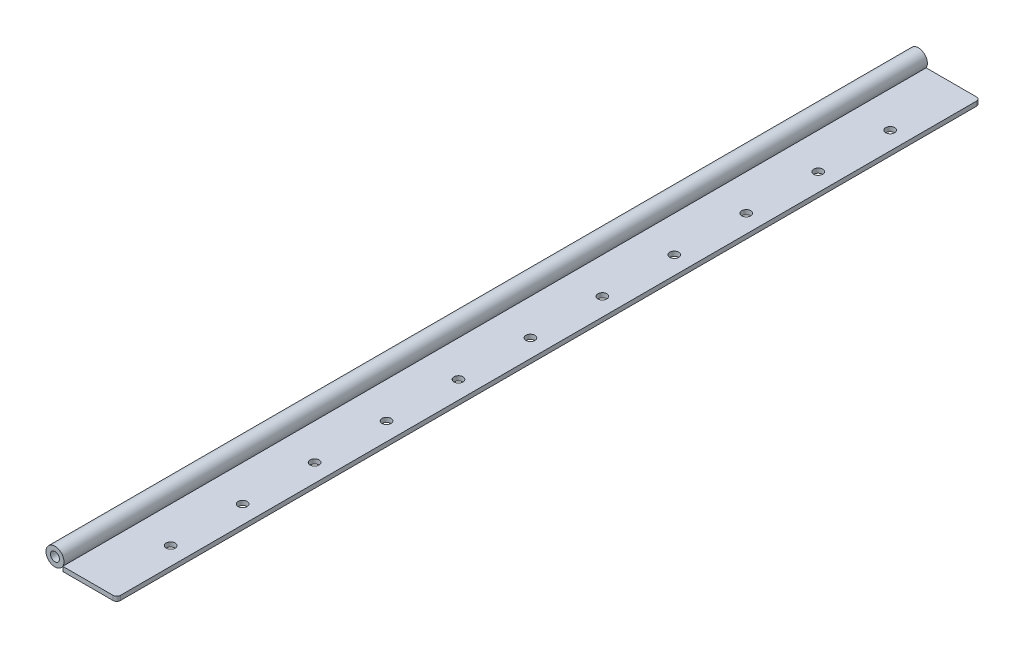
ISO-10303-21;
HEADER;
FILE_DESCRIPTION(('STEP AP214'),'2;1');
FILE_NAME('part.step','',(''),(''),'','','');
FILE_SCHEMA(('AUTOMOTIVE_DESIGN { 1 0 10303 214 1 1 1 1 }'));
ENDSEC;
DATA;
#1=APPLICATION_CONTEXT('core data for automotive mechanical design processes');
#2=APPLICATION_PROTOCOL_DEFINITION('international standard','automotive_design',2000,#1);
#3=PRODUCT_CONTEXT('',#1,'mechanical');
#4=PRODUCT('Part','Part','',(#3));
#5=PRODUCT_RELATED_PRODUCT_CATEGORY('part','',(#4));
#6=PRODUCT_DEFINITION_FORMATION('','',#4);
#7=PRODUCT_DEFINITION_CONTEXT('part definition',#1,'design');
#8=PRODUCT_DEFINITION('design','',#6,#7);
#9=PRODUCT_DEFINITION_SHAPE('','',#8);
#10=(LENGTH_UNIT() NAMED_UNIT(*) SI_UNIT(.MILLI.,.METRE.));
#11=(NAMED_UNIT(*) PLANE_ANGLE_UNIT() SI_UNIT($,.RADIAN.));
#12=(NAMED_UNIT(*) SI_UNIT($,.STERADIAN.) SOLID_ANGLE_UNIT());
#13=UNCERTAINTY_MEASURE_WITH_UNIT(LENGTH_MEASURE(1.E-05),#10,'distance_accuracy_value','');
#14=(GEOMETRIC_REPRESENTATION_CONTEXT(3) GLOBAL_UNCERTAINTY_ASSIGNED_CONTEXT((#13)) GLOBAL_UNIT_ASSIGNED_CONTEXT((#10,
#11,#12)) REPRESENTATION_CONTEXT('',''));
#15=CARTESIAN_POINT('',(0.,0.,0.));
#16=DIRECTION('',(0.,0.,1.));
#17=DIRECTION('',(1.,0.,0.));
#18=AXIS2_PLACEMENT_3D('',#15,#16,#17);
#19=CARTESIAN_POINT('',(-5.49926131403118,6.35,-609.6));
#20=DIRECTION('',(0.,0.,1.));
#21=DIRECTION('',(1.,0.,0.));
#22=AXIS2_PLACEMENT_3D('',#19,#20,#21);
#23=CYLINDRICAL_SURFACE('',#22,6.35);
#24=CARTESIAN_POINT('',(-5.49926131403118,6.35,-609.6));
#25=DIRECTION('',(0.,0.,1.));
#26=DIRECTION('',(1.,0.,0.));
#27=AXIS2_PLACEMENT_3D('',#24,#25,#26);
#28=CIRCLE('',#27,6.35);
#29=CARTESIAN_POINT('',(0.850738685968815,6.35,-609.6));
#30=VERTEX_POINT('',#29);
#31=EDGE_CURVE('E11',#30,#30,#28,.T.);
#32=ORIENTED_EDGE('',*,*,#31,.T.);
#33=EDGE_LOOP('',(#32));
#34=FACE_BOUND('',#33,.T.);
#35=CARTESIAN_POINT('',(-5.49926131403118,6.35,0.));
#36=DIRECTION('',(0.,0.,1.));
#37=DIRECTION('',(1.,0.,0.));
#38=AXIS2_PLACEMENT_3D('',#35,#36,#37);
#39=CIRCLE('',#38,6.35);
#40=CARTESIAN_POINT('',(0.850738685968815,6.35,0.));
#41=VERTEX_POINT('',#40);
#42=EDGE_CURVE('E48',#41,#41,#39,.T.);
#43=ORIENTED_EDGE('',*,*,#42,.F.);
#44=EDGE_LOOP('',(#43));
#45=FACE_BOUND('',#44,.T.);
#46=ADVANCED_FACE('F45',(#34,#45),#23,.T.);
#47=CARTESIAN_POINT('',(-5.49926131403118,6.35,-609.6));
#48=DIRECTION('',(0.,0.,1.));
#49=DIRECTION('',(1.,0.,0.));
#50=AXIS2_PLACEMENT_3D('',#47,#48,#49);
#51=PLANE('',#50);
#52=CARTESIAN_POINT('',(-5.49926131403118,6.35,-609.6));
#53=DIRECTION('',(0.,0.,1.));
#54=DIRECTION('',(1.,0.,0.));
#55=AXIS2_PLACEMENT_3D('',#52,#53,#54);
#56=CIRCLE('',#55,3.175);
#57=CARTESIAN_POINT('',(-2.32426131403118,6.35,-609.6));
#58=VERTEX_POINT('',#57);
#59=EDGE_CURVE('E55',#58,#58,#56,.T.);
#60=ORIENTED_EDGE('',*,*,#59,.T.);
#61=EDGE_LOOP('',(#60));
#62=FACE_BOUND('',#61,.T.);
#63=ORIENTED_EDGE('',*,*,#31,.F.);
#64=EDGE_LOOP('',(#63));
#65=FACE_BOUND('',#64,.T.);
#66=ADVANCED_FACE('F63',(#62,#65),#51,.F.);
#67=CARTESIAN_POINT('',(-5.49926131403118,6.35,0.));
#68=DIRECTION('',(0.,0.,1.));
#69=DIRECTION('',(1.,0.,0.));
#70=AXIS2_PLACEMENT_3D('',#67,#68,#69);
#71=PLANE('',#70);
#72=CARTESIAN_POINT('',(-5.49926131403118,6.35,0.));
#73=DIRECTION('',(0.,0.,1.));
#74=DIRECTION('',(1.,0.,0.));
#75=AXIS2_PLACEMENT_3D('',#72,#73,#74);
#76=CIRCLE('',#75,3.175);
#77=CARTESIAN_POINT('',(-2.32426131403118,6.35,0.));
#78=VERTEX_POINT('',#77);
#79=EDGE_CURVE('E57',#78,#78,#76,.T.);
#80=ORIENTED_EDGE('',*,*,#79,.F.);
#81=EDGE_LOOP('',(#80));
#82=FACE_BOUND('',#81,.T.);
#83=ORIENTED_EDGE('',*,*,#42,.T.);
#84=EDGE_LOOP('',(#83));
#85=FACE_BOUND('',#84,.T.);
#86=ADVANCED_FACE('F69',(#82,#85),#71,.T.);
#87=CARTESIAN_POINT('',(-5.49926131403118,6.35,-609.6));
#88=DIRECTION('',(0.,0.,1.));
#89=DIRECTION('',(1.,0.,0.));
#90=AXIS2_PLACEMENT_3D('',#87,#88,#89);
#91=CYLINDRICAL_SURFACE('',#90,3.175);
#92=ORIENTED_EDGE('',*,*,#59,.F.);
#93=EDGE_LOOP('',(#92));
#94=FACE_BOUND('',#93,.T.);
#95=ORIENTED_EDGE('',*,*,#79,.T.);
#96=EDGE_LOOP('',(#95));
#97=FACE_BOUND('',#96,.T.);
#98=ADVANCED_FACE('F66',(#94,#97),#91,.F.);
#99=CLOSED_SHELL('',(#46,#66,#86,#98));
#100=MANIFOLD_SOLID_BREP('B2',#99);
#101=CARTESIAN_POINT('',(0.,3.175,0.));
#102=DIRECTION('',(1.,0.,0.));
#103=DIRECTION('',(0.,0.,-1.));
#104=AXIS2_PLACEMENT_3D('',#101,#102,#103);
#105=PLANE('',#104);
#106=DIRECTION('',(0.,0.,1.));
#107=VECTOR('',#106,1.);
#108=CARTESIAN_POINT('',(0.,0.,0.));
#109=LINE('',#108,#107);
#110=CARTESIAN_POINT('',(-1.11022302462516E-13,0.,-609.6));
#111=VERTEX_POINT('',#110);
#112=CARTESIAN_POINT('',(0.,0.,0.));
#113=VERTEX_POINT('',#112);
#114=EDGE_CURVE('E179',#111,#113,#109,.T.);
#115=ORIENTED_EDGE('',*,*,#114,.T.);
#116=DIRECTION('',(0.,-1.,0.));
#117=VECTOR('',#116,1.);
#118=CARTESIAN_POINT('',(0.,3.175,0.));
#119=LINE('',#118,#117);
#120=CARTESIAN_POINT('',(0.,3.175,0.));
#121=VERTEX_POINT('',#120);
#122=EDGE_CURVE('E164',#121,#113,#119,.T.);
#123=ORIENTED_EDGE('',*,*,#122,.F.);
#124=DIRECTION('',(0.,0.,1.));
#125=VECTOR('',#124,1.);
#126=CARTESIAN_POINT('',(0.,3.175,0.));
#127=LINE('',#126,#125);
#128=CARTESIAN_POINT('',(-1.11022302462516E-13,3.175,-609.6));
#129=VERTEX_POINT('',#128);
#130=EDGE_CURVE('E168',#129,#121,#127,.T.);
#131=ORIENTED_EDGE('',*,*,#130,.F.);
#132=DIRECTION('',(0.,-1.,0.));
#133=VECTOR('',#132,1.);
#134=CARTESIAN_POINT('',(-1.11022302462516E-13,3.175,-609.6));
#135=LINE('',#134,#133);
#136=EDGE_CURVE('E181',#129,#111,#135,.T.);
#137=ORIENTED_EDGE('',*,*,#136,.T.);
#138=EDGE_LOOP('',(#115,#123,#131,#137));
#139=FACE_BOUND('',#138,.T.);
#140=ADVANCED_FACE('F107',(#139),#105,.F.);
#141=CARTESIAN_POINT('',(0.,3.175,0.));
#142=DIRECTION('',(0.,0.,-1.));
#143=DIRECTION('',(-1.,0.,0.));
#144=AXIS2_PLACEMENT_3D('',#141,#142,#143);
#145=PLANE('',#144);
#146=DIRECTION('',(1.,0.,0.));
#147=VECTOR('',#146,1.);
#148=CARTESIAN_POINT('',(0.,0.,0.));
#149=LINE('',#148,#147);
#150=CARTESIAN_POINT('',(35.56,0.,0.));
#151=VERTEX_POINT('',#150);
#152=EDGE_CURVE('E207',#113,#151,#149,.T.);
#153=ORIENTED_EDGE('',*,*,#152,.T.);
#154=DIRECTION('',(0.,-1.,0.));
#155=VECTOR('',#154,1.);
#156=CARTESIAN_POINT('',(35.56,3.175,0.));
#157=LINE('',#156,#155);
#158=CARTESIAN_POINT('',(35.56,3.175,0.));
#159=VERTEX_POINT('',#158);
#160=EDGE_CURVE('E130',#151,#159,#157,.F.);
#161=ORIENTED_EDGE('',*,*,#160,.T.);
#162=DIRECTION('',(1.,0.,0.));
#163=VECTOR('',#162,1.);
#164=CARTESIAN_POINT('',(0.,3.175,0.));
#165=LINE('',#164,#163);
#166=EDGE_CURVE('E160',#121,#159,#165,.T.);
#167=ORIENTED_EDGE('',*,*,#166,.F.);
#168=ORIENTED_EDGE('',*,*,#122,.T.);
#169=EDGE_LOOP('',(#153,#161,#167,#168));
#170=FACE_BOUND('',#169,.T.);
#171=ADVANCED_FACE('F162',(#170),#145,.F.);
#172=CARTESIAN_POINT('',(38.1,3.175,0.));
#173=DIRECTION('',(-1.,0.,0.));
#174=DIRECTION('',(0.,0.,1.));
#175=AXIS2_PLACEMENT_3D('',#172,#173,#174);
#176=PLANE('',#175);
#177=DIRECTION('',(0.,0.,-1.));
#178=VECTOR('',#177,1.);
#179=CARTESIAN_POINT('',(38.1,3.175,0.));
#180=LINE('',#179,#178);
#181=CARTESIAN_POINT('',(38.1,3.175,-2.54));
#182=VERTEX_POINT('',#181);
#183=CARTESIAN_POINT('',(38.0999999999999,3.175,-607.06));
#184=VERTEX_POINT('',#183);
#185=EDGE_CURVE('E167',#182,#184,#180,.T.);
#186=ORIENTED_EDGE('',*,*,#185,.F.);
#187=DIRECTION('',(0.,-1.,0.));
#188=VECTOR('',#187,1.);
#189=CARTESIAN_POINT('',(38.1,3.175,-2.54));
#190=LINE('',#189,#188);
#191=CARTESIAN_POINT('',(38.1,0.,-2.54));
#192=VERTEX_POINT('',#191);
#193=EDGE_CURVE('E183',#182,#192,#190,.T.);
#194=ORIENTED_EDGE('',*,*,#193,.T.);
#195=DIRECTION('',(0.,0.,-1.));
#196=VECTOR('',#195,1.);
#197=CARTESIAN_POINT('',(38.1,0.,0.));
#198=LINE('',#197,#196);
#199=CARTESIAN_POINT('',(38.0999999999999,0.,-607.06));
#200=VERTEX_POINT('',#199);
#201=EDGE_CURVE('E208',#192,#200,#198,.T.);
#202=ORIENTED_EDGE('',*,*,#201,.T.);
#203=DIRECTION('',(0.,-1.,0.));
#204=VECTOR('',#203,1.);
#205=CARTESIAN_POINT('',(38.0999999999999,3.175,-607.06));
#206=LINE('',#205,#204);
#207=EDGE_CURVE('E180',#200,#184,#206,.F.);
#208=ORIENTED_EDGE('',*,*,#207,.T.);
#209=EDGE_LOOP('',(#186,#194,#202,#208));
#210=FACE_BOUND('',#209,.T.);
#211=ADVANCED_FACE('F199',(#210),#176,.F.);
#212=CARTESIAN_POINT('',(-1.11022302462516E-13,3.175,-609.6));
#213=DIRECTION('',(0.,0.,1.));
#214=DIRECTION('',(1.,0.,0.));
#215=AXIS2_PLACEMENT_3D('',#212,#213,#214);
#216=PLANE('',#215);
#217=DIRECTION('',(-1.,0.,0.));
#218=VECTOR('',#217,1.);
#219=CARTESIAN_POINT('',(-1.11022302462516E-13,3.175,-609.6));
#220=LINE('',#219,#218);
#221=CARTESIAN_POINT('',(35.5599999999999,3.175,-609.6));
#222=VERTEX_POINT('',#221);
#223=EDGE_CURVE('E172',#222,#129,#220,.T.);
#224=ORIENTED_EDGE('',*,*,#223,.F.);
#225=DIRECTION('',(0.,-1.,0.));
#226=VECTOR('',#225,1.);
#227=CARTESIAN_POINT('',(35.5599999999999,3.175,-609.6));
#228=LINE('',#227,#226);
#229=CARTESIAN_POINT('',(35.5599999999999,0.,-609.6));
#230=VERTEX_POINT('',#229);
#231=EDGE_CURVE('E43',#222,#230,#228,.T.);
#232=ORIENTED_EDGE('',*,*,#231,.T.);
#233=DIRECTION('',(-1.,0.,0.));
#234=VECTOR('',#233,1.);
#235=CARTESIAN_POINT('',(-1.11022302462516E-13,0.,-609.6));
#236=LINE('',#235,#234);
#237=EDGE_CURVE('E176',#230,#111,#236,.T.);
#238=ORIENTED_EDGE('',*,*,#237,.T.);
#239=ORIENTED_EDGE('',*,*,#136,.F.);
#240=EDGE_LOOP('',(#224,#232,#238,#239));
#241=FACE_BOUND('',#240,.T.);
#242=ADVANCED_FACE('F216',(#241),#216,.F.);
#243=CARTESIAN_POINT('',(-1.11022302462516E-13,3.175,-609.6));
#244=DIRECTION('',(0.,-1.,0.));
#245=DIRECTION('',(0.,0.,-1.));
#246=AXIS2_PLACEMENT_3D('',#243,#244,#245);
#247=PLANE('',#246);
#248=CARTESIAN_POINT('',(25.3999999999999,3.175,-152.4));
#249=DIRECTION('',(0.,1.,0.));
#250=DIRECTION('',(0.,0.,-1.));
#251=AXIS2_PLACEMENT_3D('',#248,#249,#250);
#252=CIRCLE('',#251,3.17499999999999);
#253=CARTESIAN_POINT('',(25.3999999999999,3.175,-155.575));
#254=VERTEX_POINT('',#253);
#255=EDGE_CURVE('E291',#254,#254,#252,.T.);
#256=ORIENTED_EDGE('',*,*,#255,.F.);
#257=EDGE_LOOP('',(#256));
#258=FACE_BOUND('',#257,.T.);
#259=CARTESIAN_POINT('',(25.3999999999999,3.175,-203.2));
#260=DIRECTION('',(0.,1.,0.));
#261=DIRECTION('',(0.,0.,-1.));
#262=AXIS2_PLACEMENT_3D('',#259,#260,#261);
#263=CIRCLE('',#262,3.17499999999999);
#264=CARTESIAN_POINT('',(25.3999999999999,3.175,-206.375));
#265=VERTEX_POINT('',#264);
#266=EDGE_CURVE('E295',#265,#265,#263,.T.);
#267=ORIENTED_EDGE('',*,*,#266,.F.);
#268=EDGE_LOOP('',(#267));
#269=FACE_BOUND('',#268,.T.);
#270=CARTESIAN_POINT('',(25.4,3.175,-50.8000000000001));
#271=DIRECTION('',(0.,1.,0.));
#272=DIRECTION('',(0.,0.,-1.));
#273=AXIS2_PLACEMENT_3D('',#270,#271,#272);
#274=CIRCLE('',#273,3.17499999999999);
#275=CARTESIAN_POINT('',(25.4,3.175,-53.975));
#276=VERTEX_POINT('',#275);
#277=EDGE_CURVE('E302',#276,#276,#274,.T.);
#278=ORIENTED_EDGE('',*,*,#277,.F.);
#279=EDGE_LOOP('',(#278));
#280=FACE_BOUND('',#279,.T.);
#281=CARTESIAN_POINT('',(25.3999999999999,3.175,-101.6));
#282=DIRECTION('',(0.,1.,0.));
#283=DIRECTION('',(0.,0.,-1.));
#284=AXIS2_PLACEMENT_3D('',#281,#282,#283);
#285=CIRCLE('',#284,3.17499999999999);
#286=CARTESIAN_POINT('',(25.3999999999999,3.175,-104.775));
#287=VERTEX_POINT('',#286);
#288=EDGE_CURVE('E308',#287,#287,#285,.T.);
#289=ORIENTED_EDGE('',*,*,#288,.F.);
#290=EDGE_LOOP('',(#289));
#291=FACE_BOUND('',#290,.T.);
#292=CARTESIAN_POINT('',(25.3999999999999,3.175,-558.8));
#293=DIRECTION('',(0.,1.,0.));
#294=DIRECTION('',(0.,0.,1.));
#295=AXIS2_PLACEMENT_3D('',#292,#293,#294);
#296=CIRCLE('',#295,3.175);
#297=CARTESIAN_POINT('',(25.3999999999999,3.175,-555.625));
#298=VERTEX_POINT('',#297);
#299=EDGE_CURVE('E314',#298,#298,#296,.T.);
#300=ORIENTED_EDGE('',*,*,#299,.F.);
#301=EDGE_LOOP('',(#300));
#302=FACE_BOUND('',#301,.T.);
#303=CARTESIAN_POINT('',(25.3999999999999,3.175,-508.));
#304=DIRECTION('',(0.,1.,0.));
#305=DIRECTION('',(0.,0.,1.));
#306=AXIS2_PLACEMENT_3D('',#303,#304,#305);
#307=CIRCLE('',#306,3.175);
#308=CARTESIAN_POINT('',(25.3999999999999,3.175,-504.825));
#309=VERTEX_POINT('',#308);
#310=EDGE_CURVE('E320',#309,#309,#307,.T.);
#311=ORIENTED_EDGE('',*,*,#310,.F.);
#312=EDGE_LOOP('',(#311));
#313=FACE_BOUND('',#312,.T.);
#314=CARTESIAN_POINT('',(25.3999999999999,3.175,-457.2));
#315=DIRECTION('',(0.,1.,0.));
#316=DIRECTION('',(0.,0.,1.));
#317=AXIS2_PLACEMENT_3D('',#314,#315,#316);
#318=CIRCLE('',#317,3.175);
#319=CARTESIAN_POINT('',(25.3999999999999,3.175,-454.025));
#320=VERTEX_POINT('',#319);
#321=EDGE_CURVE('E326',#320,#320,#318,.T.);
#322=ORIENTED_EDGE('',*,*,#321,.F.);
#323=EDGE_LOOP('',(#322));
#324=FACE_BOUND('',#323,.T.);
#325=CARTESIAN_POINT('',(25.3999999999999,3.175,-406.4));
#326=DIRECTION('',(0.,1.,0.));
#327=DIRECTION('',(0.,0.,1.));
#328=AXIS2_PLACEMENT_3D('',#325,#326,#327);
#329=CIRCLE('',#328,3.175);
#330=CARTESIAN_POINT('',(25.3999999999999,3.175,-403.225));
#331=VERTEX_POINT('',#330);
#332=EDGE_CURVE('E332',#331,#331,#329,.T.);
#333=ORIENTED_EDGE('',*,*,#332,.F.);
#334=EDGE_LOOP('',(#333));
#335=FACE_BOUND('',#334,.T.);
#336=CARTESIAN_POINT('',(25.3999999999999,3.175,-254.));
#337=DIRECTION('',(0.,1.,0.));
#338=DIRECTION('',(0.,0.,-1.));
#339=AXIS2_PLACEMENT_3D('',#336,#337,#338);
#340=CIRCLE('',#339,3.17499999999999);
#341=CARTESIAN_POINT('',(25.3999999999999,3.175,-257.175));
#342=VERTEX_POINT('',#341);
#343=EDGE_CURVE('E338',#342,#342,#340,.T.);
#344=ORIENTED_EDGE('',*,*,#343,.F.);
#345=EDGE_LOOP('',(#344));
#346=FACE_BOUND('',#345,.T.);
#347=CARTESIAN_POINT('',(25.3999999999999,3.175,-304.8));
#348=DIRECTION('',(0.,1.,0.));
#349=DIRECTION('',(0.,0.,1.));
#350=AXIS2_PLACEMENT_3D('',#347,#348,#349);
#351=CIRCLE('',#350,3.175);
#352=CARTESIAN_POINT('',(25.3999999999999,3.175,-301.625));
#353=VERTEX_POINT('',#352);
#354=EDGE_CURVE('E344',#353,#353,#351,.T.);
#355=ORIENTED_EDGE('',*,*,#354,.F.);
#356=EDGE_LOOP('',(#355));
#357=FACE_BOUND('',#356,.T.);
#358=CARTESIAN_POINT('',(25.3999999999999,3.175,-355.6));
#359=DIRECTION('',(0.,1.,0.));
#360=DIRECTION('',(0.,0.,1.));
#361=AXIS2_PLACEMENT_3D('',#358,#359,#360);
#362=CIRCLE('',#361,3.175);
#363=CARTESIAN_POINT('',(25.3999999999999,3.175,-352.425));
#364=VERTEX_POINT('',#363);
#365=EDGE_CURVE('E211',#364,#364,#362,.T.);
#366=ORIENTED_EDGE('',*,*,#365,.F.);
#367=EDGE_LOOP('',(#366));
#368=FACE_BOUND('',#367,.T.);
#369=ORIENTED_EDGE('',*,*,#166,.T.);
#370=CARTESIAN_POINT('',(35.56,3.175,-2.54));
#371=DIRECTION('',(0.,-1.,0.));
#372=DIRECTION('',(0.,0.,-1.));
#373=AXIS2_PLACEMENT_3D('',#370,#371,#372);
#374=CIRCLE('',#373,2.54);
#375=EDGE_CURVE('E115',#159,#182,#374,.F.);
#376=ORIENTED_EDGE('',*,*,#375,.T.);
#377=ORIENTED_EDGE('',*,*,#185,.T.);
#378=CARTESIAN_POINT('',(35.5599999999999,3.175,-607.06));
#379=DIRECTION('',(0.,-1.,0.));
#380=DIRECTION('',(0.,0.,-1.));
#381=AXIS2_PLACEMENT_3D('',#378,#379,#380);
#382=CIRCLE('',#381,2.54);
#383=EDGE_CURVE('E122',#184,#222,#382,.F.);
#384=ORIENTED_EDGE('',*,*,#383,.T.);
#385=ORIENTED_EDGE('',*,*,#223,.T.);
#386=ORIENTED_EDGE('',*,*,#130,.T.);
#387=EDGE_LOOP('',(#369,#376,#377,#384,#385,#386));
#388=FACE_BOUND('',#387,.T.);
#389=ADVANCED_FACE('F171',(#258,#269,#280,#291,#302,#313,#324,#335,#346,#357,#368,#388),#247,.F.);
#390=CARTESIAN_POINT('',(-1.11022302462516E-13,0.,-609.6));
#391=DIRECTION('',(0.,-1.,0.));
#392=DIRECTION('',(0.,0.,-1.));
#393=AXIS2_PLACEMENT_3D('',#390,#391,#392);
#394=PLANE('',#393);
#395=CARTESIAN_POINT('',(25.3999999999999,0.,-152.4));
#396=DIRECTION('',(0.,-1.,0.));
#397=DIRECTION('',(0.,0.,-1.));
#398=AXIS2_PLACEMENT_3D('',#395,#396,#397);
#399=CIRCLE('',#398,3.17499999999999);
#400=CARTESIAN_POINT('',(25.3999999999999,0.,-155.575));
#401=VERTEX_POINT('',#400);
#402=EDGE_CURVE('E288',#401,#401,#399,.F.);
#403=ORIENTED_EDGE('',*,*,#402,.T.);
#404=EDGE_LOOP('',(#403));
#405=FACE_BOUND('',#404,.T.);
#406=CARTESIAN_POINT('',(25.3999999999999,0.,-203.2));
#407=DIRECTION('',(0.,-1.,0.));
#408=DIRECTION('',(0.,0.,-1.));
#409=AXIS2_PLACEMENT_3D('',#406,#407,#408);
#410=CIRCLE('',#409,3.17499999999999);
#411=CARTESIAN_POINT('',(25.3999999999999,0.,-206.375));
#412=VERTEX_POINT('',#411);
#413=EDGE_CURVE('E292',#412,#412,#410,.F.);
#414=ORIENTED_EDGE('',*,*,#413,.T.);
#415=EDGE_LOOP('',(#414));
#416=FACE_BOUND('',#415,.T.);
#417=CARTESIAN_POINT('',(25.4,0.,-50.8000000000001));
#418=DIRECTION('',(0.,-1.,0.));
#419=DIRECTION('',(0.,0.,-1.));
#420=AXIS2_PLACEMENT_3D('',#417,#418,#419);
#421=CIRCLE('',#420,3.17499999999999);
#422=CARTESIAN_POINT('',(25.4,0.,-53.975));
#423=VERTEX_POINT('',#422);
#424=EDGE_CURVE('E300',#423,#423,#421,.F.);
#425=ORIENTED_EDGE('',*,*,#424,.T.);
#426=EDGE_LOOP('',(#425));
#427=FACE_BOUND('',#426,.T.);
#428=CARTESIAN_POINT('',(25.3999999999999,0.,-101.6));
#429=DIRECTION('',(0.,-1.,0.));
#430=DIRECTION('',(0.,0.,-1.));
#431=AXIS2_PLACEMENT_3D('',#428,#429,#430);
#432=CIRCLE('',#431,3.17499999999999);
#433=CARTESIAN_POINT('',(25.3999999999999,0.,-104.775));
#434=VERTEX_POINT('',#433);
#435=EDGE_CURVE('E305',#434,#434,#432,.F.);
#436=ORIENTED_EDGE('',*,*,#435,.T.);
#437=EDGE_LOOP('',(#436));
#438=FACE_BOUND('',#437,.T.);
#439=CARTESIAN_POINT('',(25.3999999999999,0.,-558.8));
#440=DIRECTION('',(0.,-1.,0.));
#441=DIRECTION('',(0.,0.,-1.));
#442=AXIS2_PLACEMENT_3D('',#439,#440,#441);
#443=CIRCLE('',#442,3.175);
#444=CARTESIAN_POINT('',(25.3999999999999,0.,-561.975));
#445=VERTEX_POINT('',#444);
#446=EDGE_CURVE('E311',#445,#445,#443,.F.);
#447=ORIENTED_EDGE('',*,*,#446,.T.);
#448=EDGE_LOOP('',(#447));
#449=FACE_BOUND('',#448,.T.);
#450=CARTESIAN_POINT('',(25.3999999999999,0.,-508.));
#451=DIRECTION('',(0.,-1.,0.));
#452=DIRECTION('',(0.,0.,-1.));
#453=AXIS2_PLACEMENT_3D('',#450,#451,#452);
#454=CIRCLE('',#453,3.175);
#455=CARTESIAN_POINT('',(25.3999999999999,0.,-511.175));
#456=VERTEX_POINT('',#455);
#457=EDGE_CURVE('E317',#456,#456,#454,.F.);
#458=ORIENTED_EDGE('',*,*,#457,.T.);
#459=EDGE_LOOP('',(#458));
#460=FACE_BOUND('',#459,.T.);
#461=CARTESIAN_POINT('',(25.3999999999999,0.,-457.2));
#462=DIRECTION('',(0.,-1.,0.));
#463=DIRECTION('',(0.,0.,-1.));
#464=AXIS2_PLACEMENT_3D('',#461,#462,#463);
#465=CIRCLE('',#464,3.175);
#466=CARTESIAN_POINT('',(25.3999999999999,0.,-460.375));
#467=VERTEX_POINT('',#466);
#468=EDGE_CURVE('E323',#467,#467,#465,.F.);
#469=ORIENTED_EDGE('',*,*,#468,.T.);
#470=EDGE_LOOP('',(#469));
#471=FACE_BOUND('',#470,.T.);
#472=CARTESIAN_POINT('',(25.3999999999999,0.,-406.4));
#473=DIRECTION('',(0.,-1.,0.));
#474=DIRECTION('',(0.,0.,-1.));
#475=AXIS2_PLACEMENT_3D('',#472,#473,#474);
#476=CIRCLE('',#475,3.175);
#477=CARTESIAN_POINT('',(25.3999999999999,0.,-409.575));
#478=VERTEX_POINT('',#477);
#479=EDGE_CURVE('E329',#478,#478,#476,.F.);
#480=ORIENTED_EDGE('',*,*,#479,.T.);
#481=EDGE_LOOP('',(#480));
#482=FACE_BOUND('',#481,.T.);
#483=CARTESIAN_POINT('',(25.3999999999999,0.,-254.));
#484=DIRECTION('',(0.,-1.,0.));
#485=DIRECTION('',(0.,0.,-1.));
#486=AXIS2_PLACEMENT_3D('',#483,#484,#485);
#487=CIRCLE('',#486,3.17499999999999);
#488=CARTESIAN_POINT('',(25.3999999999999,0.,-257.175));
#489=VERTEX_POINT('',#488);
#490=EDGE_CURVE('E335',#489,#489,#487,.F.);
#491=ORIENTED_EDGE('',*,*,#490,.T.);
#492=EDGE_LOOP('',(#491));
#493=FACE_BOUND('',#492,.T.);
#494=CARTESIAN_POINT('',(25.3999999999999,0.,-304.8));
#495=DIRECTION('',(0.,-1.,0.));
#496=DIRECTION('',(0.,0.,-1.));
#497=AXIS2_PLACEMENT_3D('',#494,#495,#496);
#498=CIRCLE('',#497,3.175);
#499=CARTESIAN_POINT('',(25.3999999999999,0.,-307.975));
#500=VERTEX_POINT('',#499);
#501=EDGE_CURVE('E341',#500,#500,#498,.F.);
#502=ORIENTED_EDGE('',*,*,#501,.T.);
#503=EDGE_LOOP('',(#502));
#504=FACE_BOUND('',#503,.T.);
#505=CARTESIAN_POINT('',(25.3999999999999,0.,-355.6));
#506=DIRECTION('',(0.,-1.,0.));
#507=DIRECTION('',(0.,0.,-1.));
#508=AXIS2_PLACEMENT_3D('',#505,#506,#507);
#509=CIRCLE('',#508,3.175);
#510=CARTESIAN_POINT('',(25.3999999999999,0.,-358.775));
#511=VERTEX_POINT('',#510);
#512=EDGE_CURVE('E347',#511,#511,#509,.F.);
#513=ORIENTED_EDGE('',*,*,#512,.T.);
#514=EDGE_LOOP('',(#513));
#515=FACE_BOUND('',#514,.T.);
#516=ORIENTED_EDGE('',*,*,#201,.F.);
#517=CARTESIAN_POINT('',(35.56,0.,-2.54));
#518=DIRECTION('',(0.,-1.,0.));
#519=DIRECTION('',(0.,0.,-1.));
#520=AXIS2_PLACEMENT_3D('',#517,#518,#519);
#521=CIRCLE('',#520,2.54);
#522=EDGE_CURVE('E192',#192,#151,#521,.T.);
#523=ORIENTED_EDGE('',*,*,#522,.T.);
#524=ORIENTED_EDGE('',*,*,#152,.F.);
#525=ORIENTED_EDGE('',*,*,#114,.F.);
#526=ORIENTED_EDGE('',*,*,#237,.F.);
#527=CARTESIAN_POINT('',(35.5599999999999,0.,-607.06));
#528=DIRECTION('',(0.,-1.,0.));
#529=DIRECTION('',(0.,0.,-1.));
#530=AXIS2_PLACEMENT_3D('',#527,#528,#529);
#531=CIRCLE('',#530,2.54);
#532=EDGE_CURVE('E190',#230,#200,#531,.T.);
#533=ORIENTED_EDGE('',*,*,#532,.T.);
#534=EDGE_LOOP('',(#516,#523,#524,#525,#526,#533));
#535=FACE_BOUND('',#534,.T.);
#536=ADVANCED_FACE('F206',(#405,#416,#427,#438,#449,#460,#471,#482,#493,#504,#515,#535),#394,.T.);
#537=CARTESIAN_POINT('',(25.3999999999999,-0.00100000000000013,-355.6));
#538=DIRECTION('',(0.,1.,0.));
#539=DIRECTION('',(0.,0.,1.));
#540=AXIS2_PLACEMENT_3D('',#537,#538,#539);
#541=CYLINDRICAL_SURFACE('',#540,3.175);
#542=ORIENTED_EDGE('',*,*,#512,.F.);
#543=EDGE_LOOP('',(#542));
#544=FACE_BOUND('',#543,.T.);
#545=ORIENTED_EDGE('',*,*,#365,.T.);
#546=EDGE_LOOP('',(#545));
#547=FACE_BOUND('',#546,.T.);
#548=ADVANCED_FACE('F237',(#544,#547),#541,.F.);
#549=CARTESIAN_POINT('',(25.3999999999999,-0.00100000000000013,-304.8));
#550=DIRECTION('',(0.,1.,0.));
#551=DIRECTION('',(0.,0.,1.));
#552=AXIS2_PLACEMENT_3D('',#549,#550,#551);
#553=CYLINDRICAL_SURFACE('',#552,3.175);
#554=ORIENTED_EDGE('',*,*,#501,.F.);
#555=EDGE_LOOP('',(#554));
#556=FACE_BOUND('',#555,.T.);
#557=ORIENTED_EDGE('',*,*,#354,.T.);
#558=EDGE_LOOP('',(#557));
#559=FACE_BOUND('',#558,.T.);
#560=ADVANCED_FACE('F244',(#556,#559),#553,.F.);
#561=CARTESIAN_POINT('',(25.3999999999999,-0.00100000000000013,-254.));
#562=DIRECTION('',(0.,1.,0.));
#563=DIRECTION('',(0.,0.,1.));
#564=AXIS2_PLACEMENT_3D('',#561,#562,#563);
#565=CYLINDRICAL_SURFACE('',#564,3.17499999999999);
#566=ORIENTED_EDGE('',*,*,#490,.F.);
#567=EDGE_LOOP('',(#566));
#568=FACE_BOUND('',#567,.T.);
#569=ORIENTED_EDGE('',*,*,#343,.T.);
#570=EDGE_LOOP('',(#569));
#571=FACE_BOUND('',#570,.T.);
#572=ADVANCED_FACE('F248',(#568,#571),#565,.F.);
#573=CARTESIAN_POINT('',(25.3999999999999,-0.00100000000000013,-406.4));
#574=DIRECTION('',(0.,1.,0.));
#575=DIRECTION('',(0.,0.,1.));
#576=AXIS2_PLACEMENT_3D('',#573,#574,#575);
#577=CYLINDRICAL_SURFACE('',#576,3.175);
#578=ORIENTED_EDGE('',*,*,#479,.F.);
#579=EDGE_LOOP('',(#578));
#580=FACE_BOUND('',#579,.T.);
#581=ORIENTED_EDGE('',*,*,#332,.T.);
#582=EDGE_LOOP('',(#581));
#583=FACE_BOUND('',#582,.T.);
#584=ADVANCED_FACE('F252',(#580,#583),#577,.F.);
#585=CARTESIAN_POINT('',(25.3999999999999,-0.00100000000000013,-457.2));
#586=DIRECTION('',(0.,1.,0.));
#587=DIRECTION('',(0.,0.,1.));
#588=AXIS2_PLACEMENT_3D('',#585,#586,#587);
#589=CYLINDRICAL_SURFACE('',#588,3.175);
#590=ORIENTED_EDGE('',*,*,#468,.F.);
#591=EDGE_LOOP('',(#590));
#592=FACE_BOUND('',#591,.T.);
#593=ORIENTED_EDGE('',*,*,#321,.T.);
#594=EDGE_LOOP('',(#593));
#595=FACE_BOUND('',#594,.T.);
#596=ADVANCED_FACE('F256',(#592,#595),#589,.F.);
#597=CARTESIAN_POINT('',(25.3999999999999,-0.00100000000000013,-508.));
#598=DIRECTION('',(0.,1.,0.));
#599=DIRECTION('',(0.,0.,1.));
#600=AXIS2_PLACEMENT_3D('',#597,#598,#599);
#601=CYLINDRICAL_SURFACE('',#600,3.175);
#602=ORIENTED_EDGE('',*,*,#457,.F.);
#603=EDGE_LOOP('',(#602));
#604=FACE_BOUND('',#603,.T.);
#605=ORIENTED_EDGE('',*,*,#310,.T.);
#606=EDGE_LOOP('',(#605));
#607=FACE_BOUND('',#606,.T.);
#608=ADVANCED_FACE('F260',(#604,#607),#601,.F.);
#609=CARTESIAN_POINT('',(25.3999999999999,-0.00100000000000013,-558.8));
#610=DIRECTION('',(0.,1.,0.));
#611=DIRECTION('',(0.,0.,1.));
#612=AXIS2_PLACEMENT_3D('',#609,#610,#611);
#613=CYLINDRICAL_SURFACE('',#612,3.175);
#614=ORIENTED_EDGE('',*,*,#446,.F.);
#615=EDGE_LOOP('',(#614));
#616=FACE_BOUND('',#615,.T.);
#617=ORIENTED_EDGE('',*,*,#299,.T.);
#618=EDGE_LOOP('',(#617));
#619=FACE_BOUND('',#618,.T.);
#620=ADVANCED_FACE('F264',(#616,#619),#613,.F.);
#621=CARTESIAN_POINT('',(25.3999999999999,-0.00100000000000013,-101.6));
#622=DIRECTION('',(0.,1.,0.));
#623=DIRECTION('',(0.,0.,1.));
#624=AXIS2_PLACEMENT_3D('',#621,#622,#623);
#625=CYLINDRICAL_SURFACE('',#624,3.17499999999999);
#626=ORIENTED_EDGE('',*,*,#435,.F.);
#627=EDGE_LOOP('',(#626));
#628=FACE_BOUND('',#627,.T.);
#629=ORIENTED_EDGE('',*,*,#288,.T.);
#630=EDGE_LOOP('',(#629));
#631=FACE_BOUND('',#630,.T.);
#632=ADVANCED_FACE('F268',(#628,#631),#625,.F.);
#633=CARTESIAN_POINT('',(25.4,-0.00100000000000013,-50.8000000000001));
#634=DIRECTION('',(0.,1.,0.));
#635=DIRECTION('',(0.,0.,1.));
#636=AXIS2_PLACEMENT_3D('',#633,#634,#635);
#637=CYLINDRICAL_SURFACE('',#636,3.17499999999999);
#638=ORIENTED_EDGE('',*,*,#424,.F.);
#639=EDGE_LOOP('',(#638));
#640=FACE_BOUND('',#639,.T.);
#641=ORIENTED_EDGE('',*,*,#277,.T.);
#642=EDGE_LOOP('',(#641));
#643=FACE_BOUND('',#642,.T.);
#644=ADVANCED_FACE('F272',(#640,#643),#637,.F.);
#645=CARTESIAN_POINT('',(25.3999999999999,-0.00100000000000013,-203.2));
#646=DIRECTION('',(0.,1.,0.));
#647=DIRECTION('',(0.,0.,1.));
#648=AXIS2_PLACEMENT_3D('',#645,#646,#647);
#649=CYLINDRICAL_SURFACE('',#648,3.17499999999999);
#650=ORIENTED_EDGE('',*,*,#413,.F.);
#651=EDGE_LOOP('',(#650));
#652=FACE_BOUND('',#651,.T.);
#653=ORIENTED_EDGE('',*,*,#266,.T.);
#654=EDGE_LOOP('',(#653));
#655=FACE_BOUND('',#654,.T.);
#656=ADVANCED_FACE('F276',(#652,#655),#649,.F.);
#657=CARTESIAN_POINT('',(25.3999999999999,-0.00100000000000013,-152.4));
#658=DIRECTION('',(0.,1.,0.));
#659=DIRECTION('',(0.,0.,1.));
#660=AXIS2_PLACEMENT_3D('',#657,#658,#659);
#661=CYLINDRICAL_SURFACE('',#660,3.17499999999999);
#662=ORIENTED_EDGE('',*,*,#402,.F.);
#663=EDGE_LOOP('',(#662));
#664=FACE_BOUND('',#663,.T.);
#665=ORIENTED_EDGE('',*,*,#255,.T.);
#666=EDGE_LOOP('',(#665));
#667=FACE_BOUND('',#666,.T.);
#668=ADVANCED_FACE('F223',(#664,#667),#661,.F.);
#669=CARTESIAN_POINT('',(35.56,3.175,-2.54));
#670=DIRECTION('',(0.,-1.,0.));
#671=DIRECTION('',(0.,0.,-1.));
#672=AXIS2_PLACEMENT_3D('',#669,#670,#671);
#673=CYLINDRICAL_SURFACE('',#672,2.54);
#674=ORIENTED_EDGE('',*,*,#375,.F.);
#675=ORIENTED_EDGE('',*,*,#160,.F.);
#676=ORIENTED_EDGE('',*,*,#522,.F.);
#677=ORIENTED_EDGE('',*,*,#193,.F.);
#678=EDGE_LOOP('',(#674,#675,#676,#677));
#679=FACE_BOUND('',#678,.T.);
#680=ADVANCED_FACE('F204',(#679),#673,.T.);
#681=CARTESIAN_POINT('',(35.5599999999999,3.175,-607.06));
#682=DIRECTION('',(0.,-1.,0.));
#683=DIRECTION('',(0.,0.,-1.));
#684=AXIS2_PLACEMENT_3D('',#681,#682,#683);
#685=CYLINDRICAL_SURFACE('',#684,2.54);
#686=ORIENTED_EDGE('',*,*,#383,.F.);
#687=ORIENTED_EDGE('',*,*,#207,.F.);
#688=ORIENTED_EDGE('',*,*,#532,.F.);
#689=ORIENTED_EDGE('',*,*,#231,.F.);
#690=EDGE_LOOP('',(#686,#687,#688,#689));
#691=FACE_BOUND('',#690,.T.);
#692=ADVANCED_FACE('F109',(#691),#685,.T.);
#693=CLOSED_SHELL('',(#140,#171,#211,#242,#389,#536,#548,#560,#572,#584,#596,#608,#620,#632,
#644,#656,#668,#680,#692));
#694=MANIFOLD_SOLID_BREP('B6',#693);
#695=ADVANCED_BREP_SHAPE_REPRESENTATION('',(#18,#100,#694),#14);
#696=SHAPE_DEFINITION_REPRESENTATION(#9,#695);
ENDSEC;
END-ISO-10303-21;
